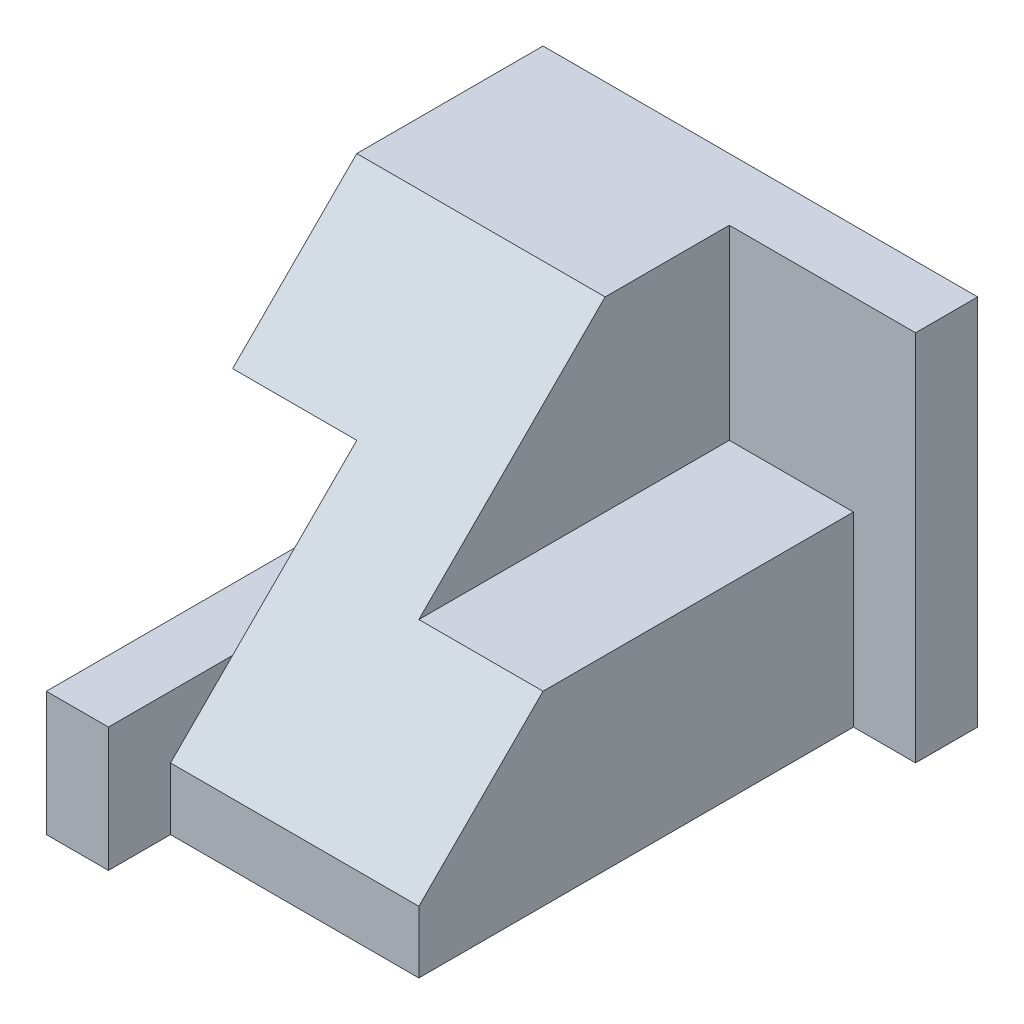
ISO-10303-21;
HEADER;
FILE_DESCRIPTION(('STEP AP214'),'2;1');
FILE_NAME('part.step','',(''),(''),'','','');
FILE_SCHEMA(('AUTOMOTIVE_DESIGN { 1 0 10303 214 1 1 1 1 }'));
ENDSEC;
DATA;
#1=APPLICATION_CONTEXT('core data for automotive mechanical design processes');
#2=APPLICATION_PROTOCOL_DEFINITION('international standard','automotive_design',2000,#1);
#3=PRODUCT_CONTEXT('',#1,'mechanical');
#4=PRODUCT('Part','Part','',(#3));
#5=PRODUCT_RELATED_PRODUCT_CATEGORY('part','',(#4));
#6=PRODUCT_DEFINITION_FORMATION('','',#4);
#7=PRODUCT_DEFINITION_CONTEXT('part definition',#1,'design');
#8=PRODUCT_DEFINITION('design','',#6,#7);
#9=PRODUCT_DEFINITION_SHAPE('','',#8);
#10=(LENGTH_UNIT() NAMED_UNIT(*) SI_UNIT(.MILLI.,.METRE.));
#11=(NAMED_UNIT(*) PLANE_ANGLE_UNIT() SI_UNIT($,.RADIAN.));
#12=(NAMED_UNIT(*) SI_UNIT($,.STERADIAN.) SOLID_ANGLE_UNIT());
#13=UNCERTAINTY_MEASURE_WITH_UNIT(LENGTH_MEASURE(1.E-05),#10,'distance_accuracy_value','');
#14=(GEOMETRIC_REPRESENTATION_CONTEXT(3) GLOBAL_UNCERTAINTY_ASSIGNED_CONTEXT((#13)) GLOBAL_UNIT_ASSIGNED_CONTEXT((#10,
#11,#12)) REPRESENTATION_CONTEXT('',''));
#15=CARTESIAN_POINT('',(0.,0.,0.));
#16=DIRECTION('',(0.,0.,1.));
#17=DIRECTION('',(1.,0.,0.));
#18=AXIS2_PLACEMENT_3D('',#15,#16,#17);
#19=CARTESIAN_POINT('',(2.5,-3.,8.));
#20=DIRECTION('',(0.,0.,-1.));
#21=DIRECTION('',(-1.,0.,0.));
#22=AXIS2_PLACEMENT_3D('',#19,#20,#21);
#23=PLANE('',#22);
#24=DIRECTION('',(0.,1.,0.));
#25=VECTOR('',#24,1.);
#26=CARTESIAN_POINT('',(2.5,-3.,8.));
#27=LINE('',#26,#25);
#28=CARTESIAN_POINT('',(2.5,-3.,8.));
#29=VERTEX_POINT('',#28);
#30=CARTESIAN_POINT('',(2.5,-2.,8.));
#31=VERTEX_POINT('',#30);
#32=EDGE_CURVE('E192',#29,#31,#27,.T.);
#33=ORIENTED_EDGE('',*,*,#32,.T.);
#34=DIRECTION('',(1.,0.,0.));
#35=VECTOR('',#34,1.);
#36=CARTESIAN_POINT('',(-1.5,-2.,8.));
#37=LINE('',#36,#35);
#38=CARTESIAN_POINT('',(-1.5,-2.,8.));
#39=VERTEX_POINT('',#38);
#40=EDGE_CURVE('E248',#39,#31,#37,.T.);
#41=ORIENTED_EDGE('',*,*,#40,.F.);
#42=DIRECTION('',(0.,1.,0.));
#43=VECTOR('',#42,1.);
#44=CARTESIAN_POINT('',(-1.5,-1.,8.));
#45=LINE('',#44,#43);
#46=CARTESIAN_POINT('',(-1.5,-3.,8.));
#47=VERTEX_POINT('',#46);
#48=EDGE_CURVE('E157',#47,#39,#45,.T.);
#49=ORIENTED_EDGE('',*,*,#48,.F.);
#50=DIRECTION('',(-1.,0.,0.));
#51=VECTOR('',#50,1.);
#52=CARTESIAN_POINT('',(2.5,-3.,8.));
#53=LINE('',#52,#51);
#54=EDGE_CURVE('E188',#29,#47,#53,.T.);
#55=ORIENTED_EDGE('',*,*,#54,.F.);
#56=EDGE_LOOP('',(#33,#41,#49,#55));
#57=FACE_BOUND('',#56,.T.);
#58=ADVANCED_FACE('F33',(#57),#23,.F.);
#59=CARTESIAN_POINT('',(-3.5,-3.,9.));
#60=DIRECTION('',(1.,0.,0.));
#61=DIRECTION('',(0.,0.,-1.));
#62=AXIS2_PLACEMENT_3D('',#59,#60,#61);
#63=PLANE('',#62);
#64=DIRECTION('',(0.,0.,1.));
#65=VECTOR('',#64,1.);
#66=CARTESIAN_POINT('',(-3.5,1.,0.));
#67=LINE('',#66,#65);
#68=CARTESIAN_POINT('',(-3.5,1.,0.));
#69=VERTEX_POINT('',#68);
#70=CARTESIAN_POINT('',(-3.5,1.,5.));
#71=VERTEX_POINT('',#70);
#72=EDGE_CURVE('E147',#69,#71,#67,.T.);
#73=ORIENTED_EDGE('',*,*,#72,.T.);
#74=DIRECTION('',(0.,0.707106781186548,-0.707106781186547));
#75=VECTOR('',#74,1.);
#76=CARTESIAN_POINT('',(-3.5,1.,5.));
#77=LINE('',#76,#75);
#78=CARTESIAN_POINT('',(-3.5,3.,3.));
#79=VERTEX_POINT('',#78);
#80=EDGE_CURVE('E135',#71,#79,#77,.T.);
#81=ORIENTED_EDGE('',*,*,#80,.T.);
#82=DIRECTION('',(0.,0.,-1.));
#83=VECTOR('',#82,1.);
#84=CARTESIAN_POINT('',(-3.5,3.,9.));
#85=LINE('',#84,#83);
#86=CARTESIAN_POINT('',(-3.5,3.,0.));
#87=VERTEX_POINT('',#86);
#88=EDGE_CURVE('E216',#79,#87,#85,.T.);
#89=ORIENTED_EDGE('',*,*,#88,.T.);
#90=DIRECTION('',(0.,-1.,0.));
#91=VECTOR('',#90,1.);
#92=CARTESIAN_POINT('',(-3.5,-3.,0.));
#93=LINE('',#92,#91);
#94=EDGE_CURVE('E154',#87,#69,#93,.T.);
#95=ORIENTED_EDGE('',*,*,#94,.T.);
#96=EDGE_LOOP('',(#73,#81,#89,#95));
#97=FACE_BOUND('',#96,.T.);
#98=ADVANCED_FACE('F35',(#97),#63,.F.);
#99=CARTESIAN_POINT('',(3.5,-3.,9.));
#100=DIRECTION('',(0.,1.,0.));
#101=DIRECTION('',(-1.,0.,0.));
#102=AXIS2_PLACEMENT_3D('',#99,#100,#101);
#103=PLANE('',#102);
#104=DIRECTION('',(1.,0.,0.));
#105=VECTOR('',#104,1.);
#106=CARTESIAN_POINT('',(3.5,-3.,9.));
#107=LINE('',#106,#105);
#108=CARTESIAN_POINT('',(-2.5,-3.,9.));
#109=VERTEX_POINT('',#108);
#110=CARTESIAN_POINT('',(-1.5,-3.,9.));
#111=VERTEX_POINT('',#110);
#112=EDGE_CURVE('E214',#109,#111,#107,.T.);
#113=ORIENTED_EDGE('',*,*,#112,.F.);
#114=DIRECTION('',(0.,0.,1.));
#115=VECTOR('',#114,1.);
#116=CARTESIAN_POINT('',(-2.5,-3.,0.));
#117=LINE('',#116,#115);
#118=CARTESIAN_POINT('',(-2.5,-3.,0.));
#119=VERTEX_POINT('',#118);
#120=EDGE_CURVE('E166',#119,#109,#117,.T.);
#121=ORIENTED_EDGE('',*,*,#120,.F.);
#122=DIRECTION('',(1.,0.,0.));
#123=VECTOR('',#122,1.);
#124=CARTESIAN_POINT('',(3.5,-3.,0.));
#125=LINE('',#124,#123);
#126=CARTESIAN_POINT('',(3.5,-3.,0.));
#127=VERTEX_POINT('',#126);
#128=EDGE_CURVE('E219',#119,#127,#125,.T.);
#129=ORIENTED_EDGE('',*,*,#128,.T.);
#130=DIRECTION('',(0.,0.,-1.));
#131=VECTOR('',#130,1.);
#132=CARTESIAN_POINT('',(3.5,-3.,9.));
#133=LINE('',#132,#131);
#134=CARTESIAN_POINT('',(3.5,-3.,0.999999999999999));
#135=VERTEX_POINT('',#134);
#136=EDGE_CURVE('E229',#135,#127,#133,.T.);
#137=ORIENTED_EDGE('',*,*,#136,.F.);
#138=DIRECTION('',(-1.,0.,0.));
#139=VECTOR('',#138,1.);
#140=CARTESIAN_POINT('',(3.5,-3.,0.999999999999999));
#141=LINE('',#140,#139);
#142=CARTESIAN_POINT('',(2.5,-3.,0.999999999999999));
#143=VERTEX_POINT('',#142);
#144=EDGE_CURVE('E182',#135,#143,#141,.T.);
#145=ORIENTED_EDGE('',*,*,#144,.T.);
#146=DIRECTION('',(0.,0.,1.));
#147=VECTOR('',#146,1.);
#148=CARTESIAN_POINT('',(2.5,-3.,0.999999999999999));
#149=LINE('',#148,#147);
#150=EDGE_CURVE('E185',#143,#29,#149,.T.);
#151=ORIENTED_EDGE('',*,*,#150,.T.);
#152=ORIENTED_EDGE('',*,*,#54,.T.);
#153=DIRECTION('',(0.,0.,-1.));
#154=VECTOR('',#153,1.);
#155=CARTESIAN_POINT('',(-1.5,-3.,8.));
#156=LINE('',#155,#154);
#157=EDGE_CURVE('E176',#111,#47,#156,.T.);
#158=ORIENTED_EDGE('',*,*,#157,.F.);
#159=EDGE_LOOP('',(#113,#121,#129,#137,#145,#151,#152,#158));
#160=FACE_BOUND('',#159,.T.);
#161=ADVANCED_FACE('F280',(#160),#103,.F.);
#162=CARTESIAN_POINT('',(3.5,-3.,9.));
#163=DIRECTION('',(-1.,0.,0.));
#164=DIRECTION('',(0.,0.,1.));
#165=AXIS2_PLACEMENT_3D('',#162,#163,#164);
#166=PLANE('',#165);
#167=DIRECTION('',(0.,1.,0.));
#168=VECTOR('',#167,1.);
#169=CARTESIAN_POINT('',(3.5,0.,0.999999999999999));
#170=LINE('',#169,#168);
#171=CARTESIAN_POINT('',(3.5,3.,0.999999999999999));
#172=VERTEX_POINT('',#171);
#173=EDGE_CURVE('E206',#135,#172,#170,.T.);
#174=ORIENTED_EDGE('',*,*,#173,.F.);
#175=ORIENTED_EDGE('',*,*,#136,.T.);
#176=DIRECTION('',(0.,1.,0.));
#177=VECTOR('',#176,1.);
#178=CARTESIAN_POINT('',(3.5,-3.,0.));
#179=LINE('',#178,#177);
#180=CARTESIAN_POINT('',(3.5,3.,0.));
#181=VERTEX_POINT('',#180);
#182=EDGE_CURVE('E221',#127,#181,#179,.T.);
#183=ORIENTED_EDGE('',*,*,#182,.T.);
#184=DIRECTION('',(0.,0.,-1.));
#185=VECTOR('',#184,1.);
#186=CARTESIAN_POINT('',(3.5,3.,9.));
#187=LINE('',#186,#185);
#188=EDGE_CURVE('E227',#172,#181,#187,.T.);
#189=ORIENTED_EDGE('',*,*,#188,.F.);
#190=EDGE_LOOP('',(#174,#175,#183,#189));
#191=FACE_BOUND('',#190,.T.);
#192=ADVANCED_FACE('F291',(#191),#166,.F.);
#193=CARTESIAN_POINT('',(3.5,3.,9.));
#194=DIRECTION('',(0.,-1.,0.));
#195=DIRECTION('',(1.,0.,0.));
#196=AXIS2_PLACEMENT_3D('',#193,#194,#195);
#197=PLANE('',#196);
#198=ORIENTED_EDGE('',*,*,#88,.F.);
#199=DIRECTION('',(1.,0.,0.));
#200=VECTOR('',#199,1.);
#201=CARTESIAN_POINT('',(-1.5,3.,3.));
#202=LINE('',#201,#200);
#203=CARTESIAN_POINT('',(0.5,3.,3.));
#204=VERTEX_POINT('',#203);
#205=EDGE_CURVE('E138',#79,#204,#202,.T.);
#206=ORIENTED_EDGE('',*,*,#205,.T.);
#207=DIRECTION('',(0.,0.,1.));
#208=VECTOR('',#207,1.);
#209=CARTESIAN_POINT('',(0.5,3.,1.));
#210=LINE('',#209,#208);
#211=CARTESIAN_POINT('',(0.5,3.,1.));
#212=VERTEX_POINT('',#211);
#213=EDGE_CURVE('E200',#212,#204,#210,.T.);
#214=ORIENTED_EDGE('',*,*,#213,.F.);
#215=DIRECTION('',(-1.,0.,0.));
#216=VECTOR('',#215,1.);
#217=CARTESIAN_POINT('',(3.5,3.,0.999999999999999));
#218=LINE('',#217,#216);
#219=EDGE_CURVE('E195',#172,#212,#218,.T.);
#220=ORIENTED_EDGE('',*,*,#219,.F.);
#221=ORIENTED_EDGE('',*,*,#188,.T.);
#222=DIRECTION('',(-1.,0.,0.));
#223=VECTOR('',#222,1.);
#224=CARTESIAN_POINT('',(3.5,3.,0.));
#225=LINE('',#224,#223);
#226=EDGE_CURVE('E217',#181,#87,#225,.T.);
#227=ORIENTED_EDGE('',*,*,#226,.T.);
#228=EDGE_LOOP('',(#198,#206,#214,#220,#221,#227));
#229=FACE_BOUND('',#228,.T.);
#230=ADVANCED_FACE('F286',(#229),#197,.F.);
#231=CARTESIAN_POINT('',(0.,0.,9.));
#232=DIRECTION('',(0.,0.,1.));
#233=DIRECTION('',(1.,0.,0.));
#234=AXIS2_PLACEMENT_3D('',#231,#232,#233);
#235=PLANE('',#234);
#236=DIRECTION('',(0.,1.,0.));
#237=VECTOR('',#236,1.);
#238=CARTESIAN_POINT('',(-2.5,-1.,9.));
#239=LINE('',#238,#237);
#240=CARTESIAN_POINT('',(-2.5,-1.,9.));
#241=VERTEX_POINT('',#240);
#242=EDGE_CURVE('E55',#109,#241,#239,.T.);
#243=ORIENTED_EDGE('',*,*,#242,.F.);
#244=ORIENTED_EDGE('',*,*,#112,.T.);
#245=DIRECTION('',(0.,-1.,0.));
#246=VECTOR('',#245,1.);
#247=CARTESIAN_POINT('',(-1.5,-3.,9.));
#248=LINE('',#247,#246);
#249=CARTESIAN_POINT('',(-1.5,-1.,9.));
#250=VERTEX_POINT('',#249);
#251=EDGE_CURVE('E173',#250,#111,#248,.T.);
#252=ORIENTED_EDGE('',*,*,#251,.F.);
#253=DIRECTION('',(-1.,0.,0.));
#254=VECTOR('',#253,1.);
#255=CARTESIAN_POINT('',(-1.5,-1.,9.));
#256=LINE('',#255,#254);
#257=EDGE_CURVE('E178',#250,#241,#256,.T.);
#258=ORIENTED_EDGE('',*,*,#257,.T.);
#259=EDGE_LOOP('',(#243,#244,#252,#258));
#260=FACE_BOUND('',#259,.T.);
#261=ADVANCED_FACE('F298',(#260),#235,.T.);
#262=CARTESIAN_POINT('',(0.,0.,0.));
#263=DIRECTION('',(0.,0.,1.));
#264=DIRECTION('',(1.,0.,0.));
#265=AXIS2_PLACEMENT_3D('',#262,#263,#264);
#266=PLANE('',#265);
#267=DIRECTION('',(0.,1.,0.));
#268=VECTOR('',#267,1.);
#269=CARTESIAN_POINT('',(-1.5,1.,0.));
#270=LINE('',#269,#268);
#271=CARTESIAN_POINT('',(-1.5,-1.,0.));
#272=VERTEX_POINT('',#271);
#273=CARTESIAN_POINT('',(-1.5,1.,0.));
#274=VERTEX_POINT('',#273);
#275=EDGE_CURVE('E257',#272,#274,#270,.T.);
#276=ORIENTED_EDGE('',*,*,#275,.T.);
#277=DIRECTION('',(-1.,0.,0.));
#278=VECTOR('',#277,1.);
#279=CARTESIAN_POINT('',(-3.5,1.,0.));
#280=LINE('',#279,#278);
#281=EDGE_CURVE('E168',#274,#69,#280,.T.);
#282=ORIENTED_EDGE('',*,*,#281,.T.);
#283=ORIENTED_EDGE('',*,*,#94,.F.);
#284=ORIENTED_EDGE('',*,*,#226,.F.);
#285=ORIENTED_EDGE('',*,*,#182,.F.);
#286=ORIENTED_EDGE('',*,*,#128,.F.);
#287=DIRECTION('',(0.,1.,0.));
#288=VECTOR('',#287,1.);
#289=CARTESIAN_POINT('',(-2.5,-1.,0.));
#290=LINE('',#289,#288);
#291=CARTESIAN_POINT('',(-2.5,-1.,0.));
#292=VERTEX_POINT('',#291);
#293=EDGE_CURVE('E247',#119,#292,#290,.T.);
#294=ORIENTED_EDGE('',*,*,#293,.T.);
#295=DIRECTION('',(1.,0.,0.));
#296=VECTOR('',#295,1.);
#297=CARTESIAN_POINT('',(-1.5,-1.,0.));
#298=LINE('',#297,#296);
#299=EDGE_CURVE('E254',#292,#272,#298,.T.);
#300=ORIENTED_EDGE('',*,*,#299,.T.);
#301=EDGE_LOOP('',(#276,#282,#283,#284,#285,#286,#294,#300));
#302=FACE_BOUND('',#301,.T.);
#303=ADVANCED_FACE('F260',(#302),#266,.F.);
#304=CARTESIAN_POINT('',(0.5,0.,1.));
#305=DIRECTION('',(-1.,0.,0.));
#306=DIRECTION('',(0.,0.,1.));
#307=AXIS2_PLACEMENT_3D('',#304,#305,#306);
#308=PLANE('',#307);
#309=ORIENTED_EDGE('',*,*,#213,.T.);
#310=DIRECTION('',(0.,-0.707106781186548,0.707106781186547));
#311=VECTOR('',#310,1.);
#312=CARTESIAN_POINT('',(0.5,2.5,3.5));
#313=LINE('',#312,#311);
#314=CARTESIAN_POINT('',(0.5,0.,6.));
#315=VERTEX_POINT('',#314);
#316=EDGE_CURVE('E242',#204,#315,#313,.T.);
#317=ORIENTED_EDGE('',*,*,#316,.T.);
#318=DIRECTION('',(0.,0.,1.));
#319=VECTOR('',#318,1.);
#320=CARTESIAN_POINT('',(0.5,0.,1.));
#321=LINE('',#320,#319);
#322=CARTESIAN_POINT('',(0.5,0.,1.));
#323=VERTEX_POINT('',#322);
#324=EDGE_CURVE('E199',#323,#315,#321,.T.);
#325=ORIENTED_EDGE('',*,*,#324,.F.);
#326=DIRECTION('',(0.,1.,0.));
#327=VECTOR('',#326,1.);
#328=CARTESIAN_POINT('',(0.5,0.,1.));
#329=LINE('',#328,#327);
#330=EDGE_CURVE('E210',#323,#212,#329,.T.);
#331=ORIENTED_EDGE('',*,*,#330,.T.);
#332=EDGE_LOOP('',(#309,#317,#325,#331));
#333=FACE_BOUND('',#332,.T.);
#334=ADVANCED_FACE('F244',(#333),#308,.F.);
#335=CARTESIAN_POINT('',(3.5,0.,0.999999999999999));
#336=DIRECTION('',(0.,0.,-1.));
#337=DIRECTION('',(-1.,0.,0.));
#338=AXIS2_PLACEMENT_3D('',#335,#336,#337);
#339=PLANE('',#338);
#340=DIRECTION('',(-1.,0.,0.));
#341=VECTOR('',#340,1.);
#342=CARTESIAN_POINT('',(3.5,0.,0.999999999999999));
#343=LINE('',#342,#341);
#344=CARTESIAN_POINT('',(2.5,0.,0.999999999999999));
#345=VERTEX_POINT('',#344);
#346=EDGE_CURVE('E197',#345,#323,#343,.T.);
#347=ORIENTED_EDGE('',*,*,#346,.F.);
#348=DIRECTION('',(0.,1.,0.));
#349=VECTOR('',#348,1.);
#350=CARTESIAN_POINT('',(2.5,-3.,0.999999999999999));
#351=LINE('',#350,#349);
#352=EDGE_CURVE('E191',#143,#345,#351,.T.);
#353=ORIENTED_EDGE('',*,*,#352,.F.);
#354=ORIENTED_EDGE('',*,*,#144,.F.);
#355=ORIENTED_EDGE('',*,*,#173,.T.);
#356=ORIENTED_EDGE('',*,*,#219,.T.);
#357=ORIENTED_EDGE('',*,*,#330,.F.);
#358=EDGE_LOOP('',(#347,#353,#354,#355,#356,#357));
#359=FACE_BOUND('',#358,.T.);
#360=ADVANCED_FACE('F282',(#359),#339,.F.);
#361=CARTESIAN_POINT('',(0.,0.,0.));
#362=DIRECTION('',(0.,1.,0.));
#363=DIRECTION('',(-1.,0.,0.));
#364=AXIS2_PLACEMENT_3D('',#361,#362,#363);
#365=PLANE('',#364);
#366=DIRECTION('',(0.,0.,1.));
#367=VECTOR('',#366,1.);
#368=CARTESIAN_POINT('',(2.5,0.,0.));
#369=LINE('',#368,#367);
#370=CARTESIAN_POINT('',(2.5,0.,6.));
#371=VERTEX_POINT('',#370);
#372=EDGE_CURVE('E41',#345,#371,#369,.T.);
#373=ORIENTED_EDGE('',*,*,#372,.F.);
#374=ORIENTED_EDGE('',*,*,#346,.T.);
#375=ORIENTED_EDGE('',*,*,#324,.T.);
#376=DIRECTION('',(1.,0.,0.));
#377=VECTOR('',#376,1.);
#378=CARTESIAN_POINT('',(0.500000000000001,0.,6.));
#379=LINE('',#378,#377);
#380=EDGE_CURVE('E203',#315,#371,#379,.T.);
#381=ORIENTED_EDGE('',*,*,#380,.T.);
#382=EDGE_LOOP('',(#373,#374,#375,#381));
#383=FACE_BOUND('',#382,.T.);
#384=ADVANCED_FACE('F239',(#383),#365,.T.);
#385=CARTESIAN_POINT('',(2.5,-3.,0.999999999999999));
#386=DIRECTION('',(-1.,0.,0.));
#387=DIRECTION('',(0.,0.,1.));
#388=AXIS2_PLACEMENT_3D('',#385,#386,#387);
#389=PLANE('',#388);
#390=ORIENTED_EDGE('',*,*,#372,.T.);
#391=DIRECTION('',(0.,0.707106781186548,-0.707106781186547));
#392=VECTOR('',#391,1.);
#393=CARTESIAN_POINT('',(2.5,3.,3.));
#394=LINE('',#393,#392);
#395=EDGE_CURVE('E150',#31,#371,#394,.T.);
#396=ORIENTED_EDGE('',*,*,#395,.F.);
#397=ORIENTED_EDGE('',*,*,#32,.F.);
#398=ORIENTED_EDGE('',*,*,#150,.F.);
#399=ORIENTED_EDGE('',*,*,#352,.T.);
#400=EDGE_LOOP('',(#390,#396,#397,#398,#399));
#401=FACE_BOUND('',#400,.T.);
#402=ADVANCED_FACE('F235',(#401),#389,.F.);
#403=CARTESIAN_POINT('',(-1.5,-1.,9.));
#404=DIRECTION('',(0.,-1.,0.));
#405=DIRECTION('',(1.,0.,0.));
#406=AXIS2_PLACEMENT_3D('',#403,#404,#405);
#407=PLANE('',#406);
#408=DIRECTION('',(0.,0.,1.));
#409=VECTOR('',#408,1.);
#410=CARTESIAN_POINT('',(-2.5,-1.,9.));
#411=LINE('',#410,#409);
#412=EDGE_CURVE('E155',#292,#241,#411,.T.);
#413=ORIENTED_EDGE('',*,*,#412,.T.);
#414=ORIENTED_EDGE('',*,*,#257,.F.);
#415=DIRECTION('',(0.,0.,1.));
#416=VECTOR('',#415,1.);
#417=CARTESIAN_POINT('',(-1.5,-1.,9.));
#418=LINE('',#417,#416);
#419=CARTESIAN_POINT('',(-1.5,-1.,7.));
#420=VERTEX_POINT('',#419);
#421=EDGE_CURVE('E171',#420,#250,#418,.T.);
#422=ORIENTED_EDGE('',*,*,#421,.F.);
#423=DIRECTION('',(0.,0.,1.));
#424=VECTOR('',#423,1.);
#425=CARTESIAN_POINT('',(-1.5,-1.,0.));
#426=LINE('',#425,#424);
#427=EDGE_CURVE('E159',#272,#420,#426,.T.);
#428=ORIENTED_EDGE('',*,*,#427,.F.);
#429=ORIENTED_EDGE('',*,*,#299,.F.);
#430=EDGE_LOOP('',(#413,#414,#422,#428,#429));
#431=FACE_BOUND('',#430,.T.);
#432=ADVANCED_FACE('F307',(#431),#407,.F.);
#433=CARTESIAN_POINT('',(-1.50000000000001,0.,0.));
#434=DIRECTION('',(-1.,0.,0.));
#435=DIRECTION('',(0.,0.,1.));
#436=AXIS2_PLACEMENT_3D('',#433,#434,#435);
#437=PLANE('',#436);
#438=ORIENTED_EDGE('',*,*,#48,.T.);
#439=DIRECTION('',(0.,0.707106781186548,-0.707106781186547));
#440=VECTOR('',#439,1.);
#441=CARTESIAN_POINT('',(-1.5,3.,3.));
#442=LINE('',#441,#440);
#443=EDGE_CURVE('E267',#39,#420,#442,.T.);
#444=ORIENTED_EDGE('',*,*,#443,.T.);
#445=ORIENTED_EDGE('',*,*,#421,.T.);
#446=ORIENTED_EDGE('',*,*,#251,.T.);
#447=ORIENTED_EDGE('',*,*,#157,.T.);
#448=EDGE_LOOP('',(#438,#444,#445,#446,#447));
#449=FACE_BOUND('',#448,.T.);
#450=ADVANCED_FACE('F270',(#449),#437,.F.);
#451=CARTESIAN_POINT('',(-3.5,1.,0.));
#452=DIRECTION('',(0.,1.,0.));
#453=DIRECTION('',(-1.,0.,0.));
#454=AXIS2_PLACEMENT_3D('',#451,#452,#453);
#455=PLANE('',#454);
#456=DIRECTION('',(0.,0.,1.));
#457=VECTOR('',#456,1.);
#458=CARTESIAN_POINT('',(-1.5,1.,0.));
#459=LINE('',#458,#457);
#460=CARTESIAN_POINT('',(-1.5,1.,5.));
#461=VERTEX_POINT('',#460);
#462=EDGE_CURVE('E149',#274,#461,#459,.T.);
#463=ORIENTED_EDGE('',*,*,#462,.T.);
#464=DIRECTION('',(1.,0.,0.));
#465=VECTOR('',#464,1.);
#466=CARTESIAN_POINT('',(-3.5,1.,5.));
#467=LINE('',#466,#465);
#468=EDGE_CURVE('E48',#71,#461,#467,.T.);
#469=ORIENTED_EDGE('',*,*,#468,.F.);
#470=ORIENTED_EDGE('',*,*,#72,.F.);
#471=ORIENTED_EDGE('',*,*,#281,.F.);
#472=EDGE_LOOP('',(#463,#469,#470,#471));
#473=FACE_BOUND('',#472,.T.);
#474=ADVANCED_FACE('F145',(#473),#455,.F.);
#475=CARTESIAN_POINT('',(-1.5,1.,0.));
#476=DIRECTION('',(1.,0.,0.));
#477=DIRECTION('',(0.,1.,0.));
#478=AXIS2_PLACEMENT_3D('',#475,#476,#477);
#479=PLANE('',#478);
#480=ORIENTED_EDGE('',*,*,#427,.T.);
#481=DIRECTION('',(0.,0.707106781186548,-0.707106781186547));
#482=VECTOR('',#481,1.);
#483=CARTESIAN_POINT('',(-1.5,3.5,2.5));
#484=LINE('',#483,#482);
#485=EDGE_CURVE('E11',#420,#461,#484,.T.);
#486=ORIENTED_EDGE('',*,*,#485,.T.);
#487=ORIENTED_EDGE('',*,*,#462,.F.);
#488=ORIENTED_EDGE('',*,*,#275,.F.);
#489=EDGE_LOOP('',(#480,#486,#487,#488));
#490=FACE_BOUND('',#489,.T.);
#491=ADVANCED_FACE('F265',(#490),#479,.F.);
#492=CARTESIAN_POINT('',(-2.5,-1.,0.));
#493=DIRECTION('',(1.,0.,0.));
#494=DIRECTION('',(0.,0.,-1.));
#495=AXIS2_PLACEMENT_3D('',#492,#493,#494);
#496=PLANE('',#495);
#497=ORIENTED_EDGE('',*,*,#242,.T.);
#498=ORIENTED_EDGE('',*,*,#412,.F.);
#499=ORIENTED_EDGE('',*,*,#293,.F.);
#500=ORIENTED_EDGE('',*,*,#120,.T.);
#501=EDGE_LOOP('',(#497,#498,#499,#500));
#502=FACE_BOUND('',#501,.T.);
#503=ADVANCED_FACE('F368',(#502),#496,.F.);
#504=CARTESIAN_POINT('',(-1.5,3.,3.));
#505=DIRECTION('',(0.,-0.707106781186547,-0.707106781186548));
#506=DIRECTION('',(0.,0.707106781186548,-0.707106781186547));
#507=AXIS2_PLACEMENT_3D('',#504,#505,#506);
#508=PLANE('',#507);
#509=ORIENTED_EDGE('',*,*,#205,.F.);
#510=ORIENTED_EDGE('',*,*,#80,.F.);
#511=ORIENTED_EDGE('',*,*,#468,.T.);
#512=ORIENTED_EDGE('',*,*,#485,.F.);
#513=ORIENTED_EDGE('',*,*,#443,.F.);
#514=ORIENTED_EDGE('',*,*,#40,.T.);
#515=ORIENTED_EDGE('',*,*,#395,.T.);
#516=ORIENTED_EDGE('',*,*,#380,.F.);
#517=ORIENTED_EDGE('',*,*,#316,.F.);
#518=EDGE_LOOP('',(#509,#510,#511,#512,#513,#514,#515,#516,#517));
#519=FACE_BOUND('',#518,.T.);
#520=ADVANCED_FACE('F136',(#519),#508,.F.);
#521=CLOSED_SHELL('',(#58,#98,#161,#192,#230,#261,#303,#334,#360,#384,#402,#432,#450,#474,#491,
#503,#520));
#522=MANIFOLD_SOLID_BREP('B2',#521);
#523=ADVANCED_BREP_SHAPE_REPRESENTATION('',(#18,#522),#14);
#524=SHAPE_DEFINITION_REPRESENTATION(#9,#523);
ENDSEC;
END-ISO-10303-21;
